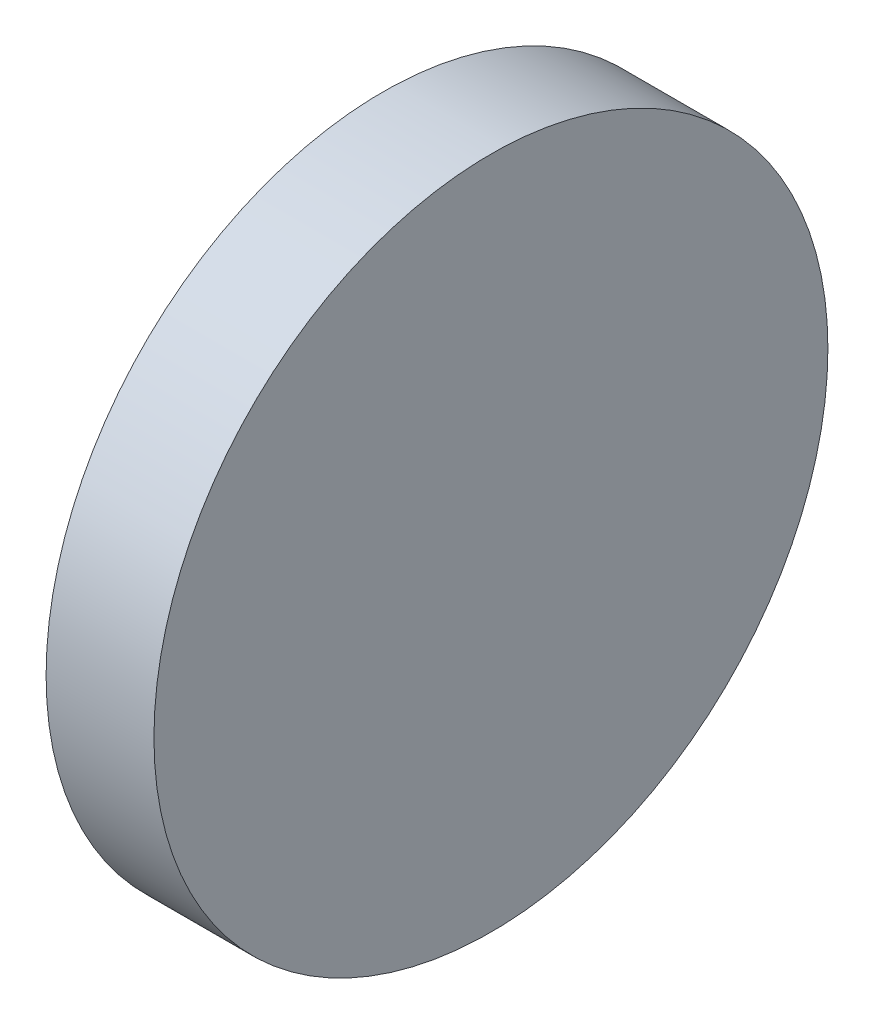
ISO-10303-21;
HEADER;
FILE_DESCRIPTION(('STEP AP214'),'2;1');
FILE_NAME('part.step','',(''),(''),'','','');
FILE_SCHEMA(('AUTOMOTIVE_DESIGN { 1 0 10303 214 1 1 1 1 }'));
ENDSEC;
DATA;
#1=APPLICATION_CONTEXT('core data for automotive mechanical design processes');
#2=APPLICATION_PROTOCOL_DEFINITION('international standard','automotive_design',2000,#1);
#3=PRODUCT_CONTEXT('',#1,'mechanical');
#4=PRODUCT('Part','Part','',(#3));
#5=PRODUCT_RELATED_PRODUCT_CATEGORY('part','',(#4));
#6=PRODUCT_DEFINITION_FORMATION('','',#4);
#7=PRODUCT_DEFINITION_CONTEXT('part definition',#1,'design');
#8=PRODUCT_DEFINITION('design','',#6,#7);
#9=PRODUCT_DEFINITION_SHAPE('','',#8);
#10=(LENGTH_UNIT() NAMED_UNIT(*) SI_UNIT(.MILLI.,.METRE.));
#11=(NAMED_UNIT(*) PLANE_ANGLE_UNIT() SI_UNIT($,.RADIAN.));
#12=(NAMED_UNIT(*) SI_UNIT($,.STERADIAN.) SOLID_ANGLE_UNIT());
#13=UNCERTAINTY_MEASURE_WITH_UNIT(LENGTH_MEASURE(1.E-05),#10,'distance_accuracy_value','');
#14=(GEOMETRIC_REPRESENTATION_CONTEXT(3) GLOBAL_UNCERTAINTY_ASSIGNED_CONTEXT((#13)) GLOBAL_UNIT_ASSIGNED_CONTEXT((#10,
#11,#12)) REPRESENTATION_CONTEXT('',''));
#15=CARTESIAN_POINT('',(0.,0.,0.));
#16=DIRECTION('',(0.,0.,1.));
#17=DIRECTION('',(1.,0.,0.));
#18=AXIS2_PLACEMENT_3D('',#15,#16,#17);
#19=CARTESIAN_POINT('',(132.07857024628,38.6465896745077,0.));
#20=DIRECTION('',(-1.,0.,0.));
#21=DIRECTION('',(0.,0.,1.));
#22=AXIS2_PLACEMENT_3D('',#19,#20,#21);
#23=PLANE('',#22);
#24=CARTESIAN_POINT('',(132.07857024628,38.6465896745077,0.));
#25=DIRECTION('',(-1.,0.,0.));
#26=DIRECTION('',(0.,0.,1.));
#27=AXIS2_PLACEMENT_3D('',#24,#25,#26);
#28=CIRCLE('',#27,6.24999999999999);
#29=CARTESIAN_POINT('',(132.07857024628,38.6465896745077,6.24999999999999));
#30=VERTEX_POINT('',#29);
#31=EDGE_CURVE('E10',#30,#30,#28,.T.);
#32=ORIENTED_EDGE('',*,*,#31,.F.);
#33=EDGE_LOOP('',(#32));
#34=FACE_BOUND('',#33,.T.);
#35=ADVANCED_FACE('F35',(#34),#23,.F.);
#36=CARTESIAN_POINT('',(127.000400996308,38.6465896745077,0.));
#37=DIRECTION('',(-1.,0.,0.));
#38=DIRECTION('',(0.,0.,1.));
#39=AXIS2_PLACEMENT_3D('',#36,#37,#38);
#40=CYLINDRICAL_SURFACE('',#39,6.24999999999999);
#41=CARTESIAN_POINT('',(130.07857024628,38.6465896745077,0.));
#42=DIRECTION('',(-1.,0.,0.));
#43=DIRECTION('',(0.,0.,1.));
#44=AXIS2_PLACEMENT_3D('',#41,#42,#43);
#45=CIRCLE('',#44,6.24999999999999);
#46=CARTESIAN_POINT('',(130.07857024628,38.6465896745077,6.24999999999999));
#47=VERTEX_POINT('',#46);
#48=EDGE_CURVE('E41',#47,#47,#45,.T.);
#49=ORIENTED_EDGE('',*,*,#48,.F.);
#50=EDGE_LOOP('',(#49));
#51=FACE_BOUND('',#50,.T.);
#52=ORIENTED_EDGE('',*,*,#31,.T.);
#53=EDGE_LOOP('',(#52));
#54=FACE_BOUND('',#53,.T.);
#55=ADVANCED_FACE('F49',(#51,#54),#40,.T.);
#56=CARTESIAN_POINT('',(130.07857024628,38.6465896745077,0.));
#57=DIRECTION('',(1.,0.,0.));
#58=DIRECTION('',(0.,0.,-1.));
#59=AXIS2_PLACEMENT_3D('',#56,#57,#58);
#60=PLANE('',#59);
#61=ORIENTED_EDGE('',*,*,#48,.T.);
#62=EDGE_LOOP('',(#61));
#63=FACE_BOUND('',#62,.T.);
#64=ADVANCED_FACE('F47',(#63),#60,.F.);
#65=CLOSED_SHELL('',(#35,#55,#64));
#66=MANIFOLD_SOLID_BREP('B2',#65);
#67=ADVANCED_BREP_SHAPE_REPRESENTATION('',(#18,#66),#14);
#68=SHAPE_DEFINITION_REPRESENTATION(#9,#67);
ENDSEC;
END-ISO-10303-21;
